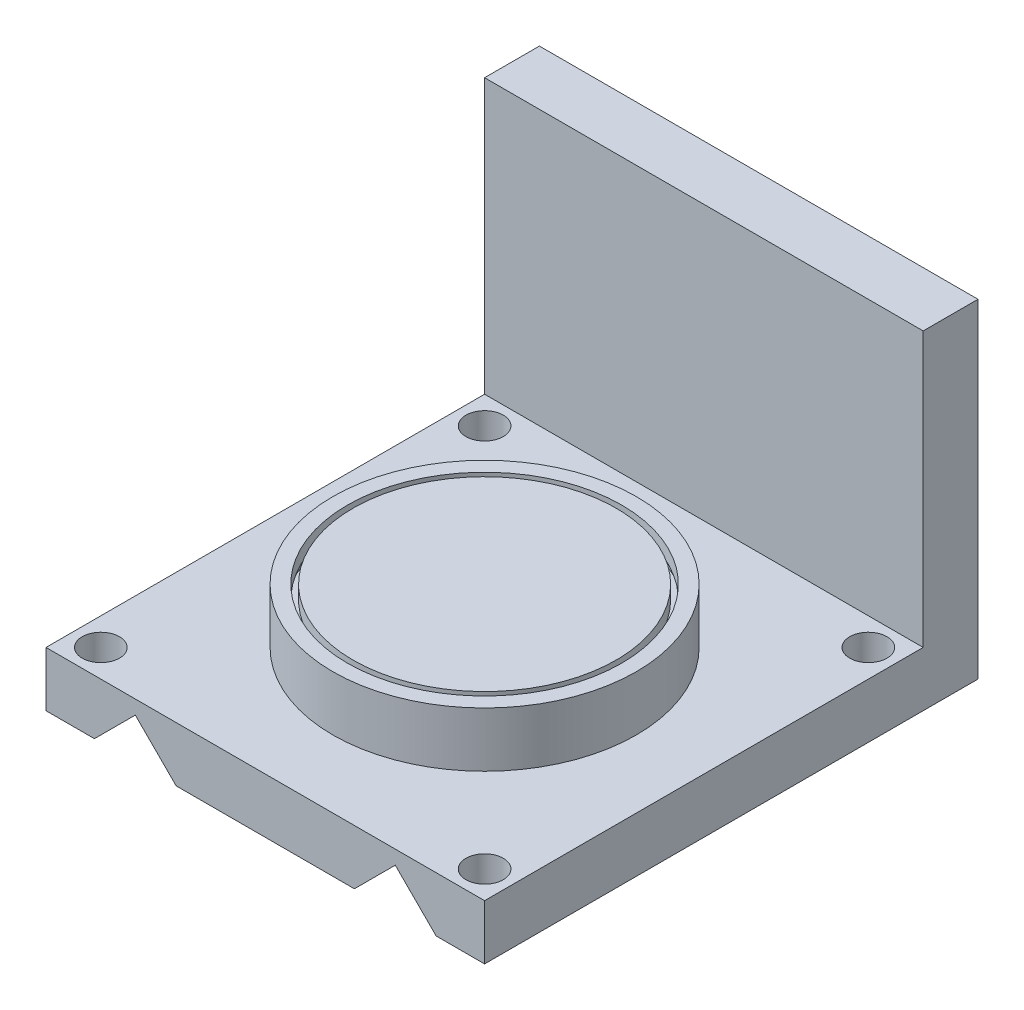
ISO-10303-21;
HEADER;
FILE_DESCRIPTION(('STEP AP214'),'2;1');
FILE_NAME('part.step','',(''),(''),'','','');
FILE_SCHEMA(('AUTOMOTIVE_DESIGN { 1 0 10303 214 1 1 1 1 }'));
ENDSEC;
DATA;
#1=APPLICATION_CONTEXT('core data for automotive mechanical design processes');
#2=APPLICATION_PROTOCOL_DEFINITION('international standard','automotive_design',2000,#1);
#3=PRODUCT_CONTEXT('',#1,'mechanical');
#4=PRODUCT('Part','Part','',(#3));
#5=PRODUCT_RELATED_PRODUCT_CATEGORY('part','',(#4));
#6=PRODUCT_DEFINITION_FORMATION('','',#4);
#7=PRODUCT_DEFINITION_CONTEXT('part definition',#1,'design');
#8=PRODUCT_DEFINITION('design','',#6,#7);
#9=PRODUCT_DEFINITION_SHAPE('','',#8);
#10=(LENGTH_UNIT() NAMED_UNIT(*) SI_UNIT(.MILLI.,.METRE.));
#11=(NAMED_UNIT(*) PLANE_ANGLE_UNIT() SI_UNIT($,.RADIAN.));
#12=(NAMED_UNIT(*) SI_UNIT($,.STERADIAN.) SOLID_ANGLE_UNIT());
#13=UNCERTAINTY_MEASURE_WITH_UNIT(LENGTH_MEASURE(1.E-05),#10,'distance_accuracy_value','');
#14=(GEOMETRIC_REPRESENTATION_CONTEXT(3) GLOBAL_UNCERTAINTY_ASSIGNED_CONTEXT((#13)) GLOBAL_UNIT_ASSIGNED_CONTEXT((#10,
#11,#12)) REPRESENTATION_CONTEXT('',''));
#15=CARTESIAN_POINT('',(0.,0.,0.));
#16=DIRECTION('',(0.,0.,1.));
#17=DIRECTION('',(1.,0.,0.));
#18=AXIS2_PLACEMENT_3D('',#15,#16,#17);
#19=CARTESIAN_POINT('',(20.,5.,20.));
#20=DIRECTION('',(-1.,0.,0.));
#21=DIRECTION('',(0.,0.,1.));
#22=AXIS2_PLACEMENT_3D('',#19,#20,#21);
#23=PLANE('',#22);
#24=DIRECTION('',(0.,0.,-1.));
#25=VECTOR('',#24,1.);
#26=CARTESIAN_POINT('',(20.,0.,20.));
#27=LINE('',#26,#25);
#28=CARTESIAN_POINT('',(20.,0.,20.));
#29=VERTEX_POINT('',#28);
#30=CARTESIAN_POINT('',(20.,0.,-25.));
#31=VERTEX_POINT('',#30);
#32=EDGE_CURVE('E124',#29,#31,#27,.T.);
#33=ORIENTED_EDGE('',*,*,#32,.T.);
#34=DIRECTION('',(0.,-1.,0.));
#35=VECTOR('',#34,1.);
#36=CARTESIAN_POINT('',(20.,30.,-25.));
#37=LINE('',#36,#35);
#38=CARTESIAN_POINT('',(20.,30.,-25.));
#39=VERTEX_POINT('',#38);
#40=EDGE_CURVE('E230',#39,#31,#37,.T.);
#41=ORIENTED_EDGE('',*,*,#40,.F.);
#42=DIRECTION('',(0.,0.,-1.));
#43=VECTOR('',#42,1.);
#44=CARTESIAN_POINT('',(20.,30.,-20.));
#45=LINE('',#44,#43);
#46=CARTESIAN_POINT('',(20.,30.,-20.));
#47=VERTEX_POINT('',#46);
#48=EDGE_CURVE('E363',#47,#39,#45,.T.);
#49=ORIENTED_EDGE('',*,*,#48,.F.);
#50=DIRECTION('',(0.,-1.,0.));
#51=VECTOR('',#50,1.);
#52=CARTESIAN_POINT('',(20.,30.,-20.));
#53=LINE('',#52,#51);
#54=CARTESIAN_POINT('',(20.,5.,-20.));
#55=VERTEX_POINT('',#54);
#56=EDGE_CURVE('E111',#47,#55,#53,.T.);
#57=ORIENTED_EDGE('',*,*,#56,.T.);
#58=DIRECTION('',(0.,0.,-1.));
#59=VECTOR('',#58,1.);
#60=CARTESIAN_POINT('',(20.,5.,20.));
#61=LINE('',#60,#59);
#62=CARTESIAN_POINT('',(20.,5.,20.));
#63=VERTEX_POINT('',#62);
#64=EDGE_CURVE('E116',#63,#55,#61,.T.);
#65=ORIENTED_EDGE('',*,*,#64,.F.);
#66=DIRECTION('',(0.,-1.,0.));
#67=VECTOR('',#66,1.);
#68=CARTESIAN_POINT('',(20.,5.,20.));
#69=LINE('',#68,#67);
#70=EDGE_CURVE('E120',#63,#29,#69,.T.);
#71=ORIENTED_EDGE('',*,*,#70,.T.);
#72=EDGE_LOOP('',(#33,#41,#49,#57,#65,#71));
#73=FACE_BOUND('',#72,.T.);
#74=ADVANCED_FACE('F37',(#73),#23,.F.);
#75=CARTESIAN_POINT('',(-20.,5.,20.));
#76=DIRECTION('',(1.,0.,0.));
#77=DIRECTION('',(0.,0.,-1.));
#78=AXIS2_PLACEMENT_3D('',#75,#76,#77);
#79=PLANE('',#78);
#80=DIRECTION('',(0.,0.,1.));
#81=VECTOR('',#80,1.);
#82=CARTESIAN_POINT('',(-20.,0.,20.));
#83=LINE('',#82,#81);
#84=CARTESIAN_POINT('',(-20.,0.,-25.));
#85=VERTEX_POINT('',#84);
#86=CARTESIAN_POINT('',(-20.,0.,20.));
#87=VERTEX_POINT('',#86);
#88=EDGE_CURVE('E67',#85,#87,#83,.T.);
#89=ORIENTED_EDGE('',*,*,#88,.T.);
#90=DIRECTION('',(0.,-1.,0.));
#91=VECTOR('',#90,1.);
#92=CARTESIAN_POINT('',(-20.,5.,20.));
#93=LINE('',#92,#91);
#94=CARTESIAN_POINT('',(-20.,5.,20.));
#95=VERTEX_POINT('',#94);
#96=EDGE_CURVE('E46',#95,#87,#93,.T.);
#97=ORIENTED_EDGE('',*,*,#96,.F.);
#98=DIRECTION('',(0.,0.,1.));
#99=VECTOR('',#98,1.);
#100=CARTESIAN_POINT('',(-20.,5.,20.));
#101=LINE('',#100,#99);
#102=CARTESIAN_POINT('',(-20.,5.,-20.));
#103=VERTEX_POINT('',#102);
#104=EDGE_CURVE('E114',#103,#95,#101,.T.);
#105=ORIENTED_EDGE('',*,*,#104,.F.);
#106=DIRECTION('',(0.,-1.,0.));
#107=VECTOR('',#106,1.);
#108=CARTESIAN_POINT('',(-20.,30.,-20.));
#109=LINE('',#108,#107);
#110=CARTESIAN_POINT('',(-20.,30.,-20.));
#111=VERTEX_POINT('',#110);
#112=EDGE_CURVE('E97',#111,#103,#109,.T.);
#113=ORIENTED_EDGE('',*,*,#112,.F.);
#114=DIRECTION('',(0.,0.,1.));
#115=VECTOR('',#114,1.);
#116=CARTESIAN_POINT('',(-20.,30.,-20.));
#117=LINE('',#116,#115);
#118=CARTESIAN_POINT('',(-20.,30.,-25.));
#119=VERTEX_POINT('',#118);
#120=EDGE_CURVE('E221',#119,#111,#117,.T.);
#121=ORIENTED_EDGE('',*,*,#120,.F.);
#122=DIRECTION('',(0.,-1.,0.));
#123=VECTOR('',#122,1.);
#124=CARTESIAN_POINT('',(-20.,30.,-25.));
#125=LINE('',#124,#123);
#126=EDGE_CURVE('E228',#119,#85,#125,.T.);
#127=ORIENTED_EDGE('',*,*,#126,.T.);
#128=EDGE_LOOP('',(#89,#97,#105,#113,#121,#127));
#129=FACE_BOUND('',#128,.T.);
#130=ADVANCED_FACE('F118',(#129),#79,.F.);
#131=CARTESIAN_POINT('',(-20.,5.,20.));
#132=DIRECTION('',(0.,0.,-1.));
#133=DIRECTION('',(-1.,0.,0.));
#134=AXIS2_PLACEMENT_3D('',#131,#132,#133);
#135=PLANE('',#134);
#136=DIRECTION('',(1.,0.,0.));
#137=VECTOR('',#136,1.);
#138=CARTESIAN_POINT('',(-20.,0.,20.));
#139=LINE('',#138,#137);
#140=CARTESIAN_POINT('',(-8.12728100073608,0.,20.));
#141=VERTEX_POINT('',#140);
#142=CARTESIAN_POINT('',(8.12728100073608,0.,20.));
#143=VERTEX_POINT('',#142);
#144=EDGE_CURVE('E133',#141,#143,#139,.T.);
#145=ORIENTED_EDGE('',*,*,#144,.T.);
#146=DIRECTION('',(-0.707106781186546,-0.707106781186549,0.));
#147=VECTOR('',#146,1.);
#148=CARTESIAN_POINT('',(8.12728100073608,0.,20.));
#149=LINE('',#148,#147);
#150=CARTESIAN_POINT('',(11.8551435979696,3.72786259723351,20.));
#151=VERTEX_POINT('',#150);
#152=EDGE_CURVE('E77',#151,#143,#149,.T.);
#153=ORIENTED_EDGE('',*,*,#152,.F.);
#154=DIRECTION('',(-0.707106781186549,0.707106781186546,0.));
#155=VECTOR('',#154,1.);
#156=CARTESIAN_POINT('',(11.8551435979696,3.72786259723351,20.));
#157=LINE('',#156,#155);
#158=CARTESIAN_POINT('',(15.5830061952031,0.,20.));
#159=VERTEX_POINT('',#158);
#160=EDGE_CURVE('E156',#159,#151,#157,.T.);
#161=ORIENTED_EDGE('',*,*,#160,.F.);
#162=EDGE_CURVE('E129',#159,#29,#139,.T.);
#163=ORIENTED_EDGE('',*,*,#162,.T.);
#164=ORIENTED_EDGE('',*,*,#70,.F.);
#165=DIRECTION('',(1.,0.,0.));
#166=VECTOR('',#165,1.);
#167=CARTESIAN_POINT('',(-20.,5.,20.));
#168=LINE('',#167,#166);
#169=EDGE_CURVE('E55',#95,#63,#168,.T.);
#170=ORIENTED_EDGE('',*,*,#169,.F.);
#171=ORIENTED_EDGE('',*,*,#96,.T.);
#172=CARTESIAN_POINT('',(-15.5830061952031,0.,20.));
#173=VERTEX_POINT('',#172);
#174=EDGE_CURVE('E130',#87,#173,#139,.T.);
#175=ORIENTED_EDGE('',*,*,#174,.T.);
#176=DIRECTION('',(-0.707106781186544,-0.707106781186551,0.));
#177=VECTOR('',#176,1.);
#178=CARTESIAN_POINT('',(-11.8551435979696,3.72786259723351,20.));
#179=LINE('',#178,#177);
#180=CARTESIAN_POINT('',(-11.8551435979696,3.72786259723351,20.));
#181=VERTEX_POINT('',#180);
#182=EDGE_CURVE('E185',#181,#173,#179,.T.);
#183=ORIENTED_EDGE('',*,*,#182,.F.);
#184=DIRECTION('',(-0.707106781186551,0.707106781186544,0.));
#185=VECTOR('',#184,1.);
#186=CARTESIAN_POINT('',(-8.12728100073608,0.,20.));
#187=LINE('',#186,#185);
#188=EDGE_CURVE('E159',#141,#181,#187,.T.);
#189=ORIENTED_EDGE('',*,*,#188,.F.);
#190=EDGE_LOOP('',(#145,#153,#161,#163,#164,#170,#171,#175,#183,#189));
#191=FACE_BOUND('',#190,.T.);
#192=ADVANCED_FACE('F200',(#191),#135,.F.);
#193=CARTESIAN_POINT('',(0.,5.,0.));
#194=DIRECTION('',(0.,-1.,0.));
#195=DIRECTION('',(0.,0.,-1.));
#196=AXIS2_PLACEMENT_3D('',#193,#194,#195);
#197=PLANE('',#196);
#198=CARTESIAN_POINT('',(0.,5.,0.));
#199=DIRECTION('',(0.,1.,0.));
#200=DIRECTION('',(0.,0.,1.));
#201=AXIS2_PLACEMENT_3D('',#198,#199,#200);
#202=CIRCLE('',#201,13.8362336587027);
#203=CARTESIAN_POINT('',(0.,5.,13.8362336587027));
#204=VERTEX_POINT('',#203);
#205=EDGE_CURVE('E11',#204,#204,#202,.T.);
#206=ORIENTED_EDGE('',*,*,#205,.F.);
#207=EDGE_LOOP('',(#206));
#208=FACE_BOUND('',#207,.T.);
#209=CARTESIAN_POINT('',(17.5,5.,17.5));
#210=DIRECTION('',(0.,1.,0.));
#211=DIRECTION('',(0.,0.,1.));
#212=AXIS2_PLACEMENT_3D('',#209,#210,#211);
#213=CIRCLE('',#212,1.7);
#214=CARTESIAN_POINT('',(17.5,5.,19.2));
#215=VERTEX_POINT('',#214);
#216=EDGE_CURVE('E256',#215,#215,#213,.T.);
#217=ORIENTED_EDGE('',*,*,#216,.F.);
#218=EDGE_LOOP('',(#217));
#219=FACE_BOUND('',#218,.T.);
#220=CARTESIAN_POINT('',(17.5,5.,-17.5));
#221=DIRECTION('',(0.,1.,0.));
#222=DIRECTION('',(0.,0.,1.));
#223=AXIS2_PLACEMENT_3D('',#220,#221,#222);
#224=CIRCLE('',#223,1.7);
#225=CARTESIAN_POINT('',(17.5,5.,-15.8));
#226=VERTEX_POINT('',#225);
#227=EDGE_CURVE('E261',#226,#226,#224,.T.);
#228=ORIENTED_EDGE('',*,*,#227,.F.);
#229=EDGE_LOOP('',(#228));
#230=FACE_BOUND('',#229,.T.);
#231=CARTESIAN_POINT('',(-17.5,5.,-17.5));
#232=DIRECTION('',(0.,1.,0.));
#233=DIRECTION('',(0.,0.,1.));
#234=AXIS2_PLACEMENT_3D('',#231,#232,#233);
#235=CIRCLE('',#234,1.7);
#236=CARTESIAN_POINT('',(-17.5,5.,-15.8));
#237=VERTEX_POINT('',#236);
#238=EDGE_CURVE('E258',#237,#237,#235,.T.);
#239=ORIENTED_EDGE('',*,*,#238,.F.);
#240=EDGE_LOOP('',(#239));
#241=FACE_BOUND('',#240,.T.);
#242=CARTESIAN_POINT('',(-17.5,5.,17.5));
#243=DIRECTION('',(0.,1.,0.));
#244=DIRECTION('',(0.,0.,1.));
#245=AXIS2_PLACEMENT_3D('',#242,#243,#244);
#246=CIRCLE('',#245,1.7);
#247=CARTESIAN_POINT('',(-17.5,5.,19.2));
#248=VERTEX_POINT('',#247);
#249=EDGE_CURVE('E140',#248,#248,#246,.T.);
#250=ORIENTED_EDGE('',*,*,#249,.F.);
#251=EDGE_LOOP('',(#250));
#252=FACE_BOUND('',#251,.T.);
#253=ORIENTED_EDGE('',*,*,#64,.T.);
#254=DIRECTION('',(-1.,0.,0.));
#255=VECTOR('',#254,1.);
#256=CARTESIAN_POINT('',(-20.,5.,-20.));
#257=LINE('',#256,#255);
#258=EDGE_CURVE('E102',#55,#103,#257,.T.);
#259=ORIENTED_EDGE('',*,*,#258,.T.);
#260=ORIENTED_EDGE('',*,*,#104,.T.);
#261=ORIENTED_EDGE('',*,*,#169,.T.);
#262=EDGE_LOOP('',(#253,#259,#260,#261));
#263=FACE_BOUND('',#262,.T.);
#264=ADVANCED_FACE('F113',(#208,#219,#230,#241,#252,#263),#197,.F.);
#265=CARTESIAN_POINT('',(0.,0.,0.));
#266=DIRECTION('',(0.,-1.,0.));
#267=DIRECTION('',(0.,0.,-1.));
#268=AXIS2_PLACEMENT_3D('',#265,#266,#267);
#269=PLANE('',#268);
#270=CARTESIAN_POINT('',(17.5,0.,17.5));
#271=DIRECTION('',(0.,-1.,0.));
#272=DIRECTION('',(0.,0.,-1.));
#273=AXIS2_PLACEMENT_3D('',#270,#271,#272);
#274=CIRCLE('',#273,1.7);
#275=CARTESIAN_POINT('',(17.5,0.,15.8));
#276=VERTEX_POINT('',#275);
#277=EDGE_CURVE('E139',#276,#276,#274,.T.);
#278=ORIENTED_EDGE('',*,*,#277,.F.);
#279=EDGE_LOOP('',(#278));
#280=FACE_BOUND('',#279,.T.);
#281=CARTESIAN_POINT('',(17.5,0.,-17.5));
#282=DIRECTION('',(0.,-1.,0.));
#283=DIRECTION('',(0.,0.,-1.));
#284=AXIS2_PLACEMENT_3D('',#281,#282,#283);
#285=CIRCLE('',#284,1.7);
#286=CARTESIAN_POINT('',(17.5,0.,-19.2));
#287=VERTEX_POINT('',#286);
#288=EDGE_CURVE('E137',#287,#287,#285,.T.);
#289=ORIENTED_EDGE('',*,*,#288,.F.);
#290=EDGE_LOOP('',(#289));
#291=FACE_BOUND('',#290,.T.);
#292=DIRECTION('',(0.,0.,1.));
#293=VECTOR('',#292,1.);
#294=CARTESIAN_POINT('',(15.5830061952031,0.,-20.));
#295=LINE('',#294,#293);
#296=CARTESIAN_POINT('',(15.5830061952031,0.,-20.));
#297=VERTEX_POINT('',#296);
#298=EDGE_CURVE('E167',#297,#159,#295,.T.);
#299=ORIENTED_EDGE('',*,*,#298,.F.);
#300=DIRECTION('',(1.,0.,0.));
#301=VECTOR('',#300,1.);
#302=CARTESIAN_POINT('',(-20.,0.,-20.));
#303=LINE('',#302,#301);
#304=CARTESIAN_POINT('',(8.12728100073607,0.,-20.));
#305=VERTEX_POINT('',#304);
#306=EDGE_CURVE('E218',#305,#297,#303,.T.);
#307=ORIENTED_EDGE('',*,*,#306,.F.);
#308=DIRECTION('',(0.,0.,1.));
#309=VECTOR('',#308,1.);
#310=CARTESIAN_POINT('',(8.12728100073608,0.,-20.));
#311=LINE('',#310,#309);
#312=EDGE_CURVE('E127',#305,#143,#311,.T.);
#313=ORIENTED_EDGE('',*,*,#312,.T.);
#314=ORIENTED_EDGE('',*,*,#144,.F.);
#315=DIRECTION('',(0.,0.,1.));
#316=VECTOR('',#315,1.);
#317=CARTESIAN_POINT('',(-8.12728100073608,0.,-20.));
#318=LINE('',#317,#316);
#319=CARTESIAN_POINT('',(-8.12728100073608,0.,-20.));
#320=VERTEX_POINT('',#319);
#321=EDGE_CURVE('E173',#320,#141,#318,.T.);
#322=ORIENTED_EDGE('',*,*,#321,.F.);
#323=CARTESIAN_POINT('',(-15.5830061952031,0.,-20.));
#324=VERTEX_POINT('',#323);
#325=EDGE_CURVE('E212',#324,#320,#303,.T.);
#326=ORIENTED_EDGE('',*,*,#325,.F.);
#327=DIRECTION('',(0.,0.,1.));
#328=VECTOR('',#327,1.);
#329=CARTESIAN_POINT('',(-15.5830061952031,0.,-20.));
#330=LINE('',#329,#328);
#331=EDGE_CURVE('E151',#324,#173,#330,.T.);
#332=ORIENTED_EDGE('',*,*,#331,.T.);
#333=ORIENTED_EDGE('',*,*,#174,.F.);
#334=ORIENTED_EDGE('',*,*,#88,.F.);
#335=DIRECTION('',(-1.,0.,0.));
#336=VECTOR('',#335,1.);
#337=CARTESIAN_POINT('',(-20.,0.,-25.));
#338=LINE('',#337,#336);
#339=EDGE_CURVE('E217',#31,#85,#338,.T.);
#340=ORIENTED_EDGE('',*,*,#339,.F.);
#341=ORIENTED_EDGE('',*,*,#32,.F.);
#342=ORIENTED_EDGE('',*,*,#162,.F.);
#343=EDGE_LOOP('',(#299,#307,#313,#314,#322,#326,#332,#333,#334,#340,#341,#342));
#344=FACE_BOUND('',#343,.T.);
#345=CARTESIAN_POINT('',(-17.5,0.,-17.5));
#346=DIRECTION('',(0.,-1.,0.));
#347=DIRECTION('',(0.,0.,-1.));
#348=AXIS2_PLACEMENT_3D('',#345,#346,#347);
#349=CIRCLE('',#348,1.7);
#350=CARTESIAN_POINT('',(-17.5,0.,-19.2));
#351=VERTEX_POINT('',#350);
#352=EDGE_CURVE('E146',#351,#351,#349,.T.);
#353=ORIENTED_EDGE('',*,*,#352,.F.);
#354=EDGE_LOOP('',(#353));
#355=FACE_BOUND('',#354,.T.);
#356=CARTESIAN_POINT('',(-17.5,0.,17.5));
#357=DIRECTION('',(0.,-1.,0.));
#358=DIRECTION('',(0.,0.,-1.));
#359=AXIS2_PLACEMENT_3D('',#356,#357,#358);
#360=CIRCLE('',#359,1.7);
#361=CARTESIAN_POINT('',(-17.5,0.,15.8));
#362=VERTEX_POINT('',#361);
#363=EDGE_CURVE('E142',#362,#362,#360,.T.);
#364=ORIENTED_EDGE('',*,*,#363,.F.);
#365=EDGE_LOOP('',(#364));
#366=FACE_BOUND('',#365,.T.);
#367=ADVANCED_FACE('F209',(#280,#291,#344,#355,#366),#269,.T.);
#368=CARTESIAN_POINT('',(-11.8551435979696,3.72786259723351,-20.));
#369=DIRECTION('',(-0.707106781186551,0.707106781186544,0.));
#370=DIRECTION('',(-0.707106781186544,-0.707106781186551,0.));
#371=AXIS2_PLACEMENT_3D('',#368,#369,#370);
#372=PLANE('',#371);
#373=ORIENTED_EDGE('',*,*,#331,.F.);
#374=DIRECTION('',(-0.707106781186544,-0.707106781186551,0.));
#375=VECTOR('',#374,1.);
#376=CARTESIAN_POINT('',(-11.8551435979696,3.72786259723351,-20.));
#377=LINE('',#376,#375);
#378=CARTESIAN_POINT('',(-11.8551435979696,3.72786259723351,-20.));
#379=VERTEX_POINT('',#378);
#380=EDGE_CURVE('E175',#379,#324,#377,.T.);
#381=ORIENTED_EDGE('',*,*,#380,.F.);
#382=DIRECTION('',(0.,0.,1.));
#383=VECTOR('',#382,1.);
#384=CARTESIAN_POINT('',(-11.8551435979696,3.72786259723351,-20.));
#385=LINE('',#384,#383);
#386=EDGE_CURVE('E176',#379,#181,#385,.T.);
#387=ORIENTED_EDGE('',*,*,#386,.T.);
#388=ORIENTED_EDGE('',*,*,#182,.T.);
#389=EDGE_LOOP('',(#373,#381,#387,#388));
#390=FACE_BOUND('',#389,.T.);
#391=ADVANCED_FACE('F204',(#390),#372,.F.);
#392=CARTESIAN_POINT('',(-8.12728100073608,0.,-20.));
#393=DIRECTION('',(0.707106781186544,0.707106781186551,0.));
#394=DIRECTION('',(-0.707106781186551,0.707106781186544,0.));
#395=AXIS2_PLACEMENT_3D('',#392,#393,#394);
#396=PLANE('',#395);
#397=ORIENTED_EDGE('',*,*,#386,.F.);
#398=DIRECTION('',(-0.707106781186551,0.707106781186544,0.));
#399=VECTOR('',#398,1.);
#400=CARTESIAN_POINT('',(-8.12728100073608,0.,-20.));
#401=LINE('',#400,#399);
#402=EDGE_CURVE('E182',#320,#379,#401,.T.);
#403=ORIENTED_EDGE('',*,*,#402,.F.);
#404=ORIENTED_EDGE('',*,*,#321,.T.);
#405=ORIENTED_EDGE('',*,*,#188,.T.);
#406=EDGE_LOOP('',(#397,#403,#404,#405));
#407=FACE_BOUND('',#406,.T.);
#408=ADVANCED_FACE('F192',(#407),#396,.F.);
#409=CARTESIAN_POINT('',(8.12728100073608,0.,-20.));
#410=DIRECTION('',(-0.707106781186549,0.707106781186546,0.));
#411=DIRECTION('',(-0.707106781186546,-0.707106781186549,0.));
#412=AXIS2_PLACEMENT_3D('',#409,#410,#411);
#413=PLANE('',#412);
#414=ORIENTED_EDGE('',*,*,#312,.F.);
#415=DIRECTION('',(-0.707106781186546,-0.707106781186549,0.));
#416=VECTOR('',#415,1.);
#417=CARTESIAN_POINT('',(8.12728100073608,0.,-20.));
#418=LINE('',#417,#416);
#419=CARTESIAN_POINT('',(11.8551435979696,3.72786259723351,-20.));
#420=VERTEX_POINT('',#419);
#421=EDGE_CURVE('E164',#420,#305,#418,.T.);
#422=ORIENTED_EDGE('',*,*,#421,.F.);
#423=DIRECTION('',(0.,0.,1.));
#424=VECTOR('',#423,1.);
#425=CARTESIAN_POINT('',(11.8551435979696,3.72786259723351,-20.));
#426=LINE('',#425,#424);
#427=EDGE_CURVE('E169',#420,#151,#426,.T.);
#428=ORIENTED_EDGE('',*,*,#427,.T.);
#429=ORIENTED_EDGE('',*,*,#152,.T.);
#430=EDGE_LOOP('',(#414,#422,#428,#429));
#431=FACE_BOUND('',#430,.T.);
#432=ADVANCED_FACE('F332',(#431),#413,.F.);
#433=CARTESIAN_POINT('',(11.8551435979696,3.72786259723351,-20.));
#434=DIRECTION('',(0.707106781186546,0.707106781186549,0.));
#435=DIRECTION('',(-0.707106781186549,0.707106781186546,0.));
#436=AXIS2_PLACEMENT_3D('',#433,#434,#435);
#437=PLANE('',#436);
#438=ORIENTED_EDGE('',*,*,#427,.F.);
#439=DIRECTION('',(-0.707106781186549,0.707106781186546,0.));
#440=VECTOR('',#439,1.);
#441=CARTESIAN_POINT('',(11.8551435979696,3.72786259723351,-20.));
#442=LINE('',#441,#440);
#443=EDGE_CURVE('E161',#297,#420,#442,.T.);
#444=ORIENTED_EDGE('',*,*,#443,.F.);
#445=ORIENTED_EDGE('',*,*,#298,.T.);
#446=ORIENTED_EDGE('',*,*,#160,.T.);
#447=EDGE_LOOP('',(#438,#444,#445,#446));
#448=FACE_BOUND('',#447,.T.);
#449=ADVANCED_FACE('F329',(#448),#437,.F.);
#450=CARTESIAN_POINT('',(17.5,-1.2E-05,-17.5));
#451=DIRECTION('',(0.,1.,0.));
#452=DIRECTION('',(0.,0.,1.));
#453=AXIS2_PLACEMENT_3D('',#450,#451,#452);
#454=CYLINDRICAL_SURFACE('',#453,1.7);
#455=ORIENTED_EDGE('',*,*,#288,.T.);
#456=EDGE_LOOP('',(#455));
#457=FACE_BOUND('',#456,.T.);
#458=ORIENTED_EDGE('',*,*,#227,.T.);
#459=EDGE_LOOP('',(#458));
#460=FACE_BOUND('',#459,.T.);
#461=ADVANCED_FACE('F290',(#457,#460),#454,.F.);
#462=CARTESIAN_POINT('',(17.5,-1.2E-05,17.5));
#463=DIRECTION('',(0.,1.,0.));
#464=DIRECTION('',(0.,0.,1.));
#465=AXIS2_PLACEMENT_3D('',#462,#463,#464);
#466=CYLINDRICAL_SURFACE('',#465,1.7);
#467=ORIENTED_EDGE('',*,*,#277,.T.);
#468=EDGE_LOOP('',(#467));
#469=FACE_BOUND('',#468,.T.);
#470=ORIENTED_EDGE('',*,*,#216,.T.);
#471=EDGE_LOOP('',(#470));
#472=FACE_BOUND('',#471,.T.);
#473=ADVANCED_FACE('F266',(#469,#472),#466,.F.);
#474=CARTESIAN_POINT('',(-17.5,-1.2E-05,17.5));
#475=DIRECTION('',(0.,1.,0.));
#476=DIRECTION('',(0.,0.,1.));
#477=AXIS2_PLACEMENT_3D('',#474,#475,#476);
#478=CYLINDRICAL_SURFACE('',#477,1.7);
#479=ORIENTED_EDGE('',*,*,#363,.T.);
#480=EDGE_LOOP('',(#479));
#481=FACE_BOUND('',#480,.T.);
#482=ORIENTED_EDGE('',*,*,#249,.T.);
#483=EDGE_LOOP('',(#482));
#484=FACE_BOUND('',#483,.T.);
#485=ADVANCED_FACE('F279',(#481,#484),#478,.F.);
#486=CARTESIAN_POINT('',(-17.5,-1.2E-05,-17.5));
#487=DIRECTION('',(0.,1.,0.));
#488=DIRECTION('',(0.,0.,1.));
#489=AXIS2_PLACEMENT_3D('',#486,#487,#488);
#490=CYLINDRICAL_SURFACE('',#489,1.7);
#491=ORIENTED_EDGE('',*,*,#352,.T.);
#492=EDGE_LOOP('',(#491));
#493=FACE_BOUND('',#492,.T.);
#494=ORIENTED_EDGE('',*,*,#238,.T.);
#495=EDGE_LOOP('',(#494));
#496=FACE_BOUND('',#495,.T.);
#497=ADVANCED_FACE('F281',(#493,#496),#490,.F.);
#498=CARTESIAN_POINT('',(0.,10.,0.));
#499=DIRECTION('',(0.,-1.,0.));
#500=DIRECTION('',(0.,0.,-1.));
#501=AXIS2_PLACEMENT_3D('',#498,#499,#500);
#502=CYLINDRICAL_SURFACE('',#501,13.8362336587027);
#503=CARTESIAN_POINT('',(0.,10.,0.));
#504=DIRECTION('',(0.,1.,0.));
#505=DIRECTION('',(0.,0.,1.));
#506=AXIS2_PLACEMENT_3D('',#503,#504,#505);
#507=CIRCLE('',#506,13.8362336587027);
#508=CARTESIAN_POINT('',(0.,10.,13.8362336587027));
#509=VERTEX_POINT('',#508);
#510=EDGE_CURVE('E254',#509,#509,#507,.T.);
#511=ORIENTED_EDGE('',*,*,#510,.F.);
#512=EDGE_LOOP('',(#511));
#513=FACE_BOUND('',#512,.T.);
#514=ORIENTED_EDGE('',*,*,#205,.T.);
#515=EDGE_LOOP('',(#514));
#516=FACE_BOUND('',#515,.T.);
#517=ADVANCED_FACE('F287',(#513,#516),#502,.T.);
#518=CARTESIAN_POINT('',(0.,10.,0.));
#519=DIRECTION('',(0.,1.,0.));
#520=DIRECTION('',(0.,0.,1.));
#521=AXIS2_PLACEMENT_3D('',#518,#519,#520);
#522=PLANE('',#521);
#523=CARTESIAN_POINT('',(0.,10.,0.));
#524=DIRECTION('',(0.,1.,0.));
#525=DIRECTION('',(0.,0.,1.));
#526=AXIS2_PLACEMENT_3D('',#523,#524,#525);
#527=CIRCLE('',#526,12.5);
#528=CARTESIAN_POINT('',(0.,10.,12.5));
#529=VERTEX_POINT('',#528);
#530=EDGE_CURVE('E251',#529,#529,#527,.T.);
#531=ORIENTED_EDGE('',*,*,#530,.F.);
#532=EDGE_LOOP('',(#531));
#533=FACE_BOUND('',#532,.T.);
#534=ORIENTED_EDGE('',*,*,#510,.T.);
#535=EDGE_LOOP('',(#534));
#536=FACE_BOUND('',#535,.T.);
#537=ADVANCED_FACE('F506',(#533,#536),#522,.T.);
#538=CARTESIAN_POINT('',(0.,7.5,0.));
#539=DIRECTION('',(0.,1.,0.));
#540=DIRECTION('',(0.,0.,1.));
#541=AXIS2_PLACEMENT_3D('',#538,#539,#540);
#542=CYLINDRICAL_SURFACE('',#541,12.5);
#543=CARTESIAN_POINT('',(0.,8.75,0.));
#544=DIRECTION('',(0.,1.,0.));
#545=DIRECTION('',(0.,0.,1.));
#546=AXIS2_PLACEMENT_3D('',#543,#544,#545);
#547=CIRCLE('',#546,12.5);
#548=CARTESIAN_POINT('',(0.,8.75,12.5));
#549=VERTEX_POINT('',#548);
#550=EDGE_CURVE('E245',#549,#549,#547,.F.);
#551=ORIENTED_EDGE('',*,*,#550,.T.);
#552=EDGE_LOOP('',(#551));
#553=FACE_BOUND('',#552,.T.);
#554=ORIENTED_EDGE('',*,*,#530,.T.);
#555=EDGE_LOOP('',(#554));
#556=FACE_BOUND('',#555,.T.);
#557=ADVANCED_FACE('F498',(#553,#556),#542,.F.);
#558=CARTESIAN_POINT('',(0.,8.75,0.));
#559=DIRECTION('',(0.,1.,0.));
#560=DIRECTION('',(0.,0.,1.));
#561=AXIS2_PLACEMENT_3D('',#558,#559,#560);
#562=PLANE('',#561);
#563=CARTESIAN_POINT('',(0.,8.75,0.));
#564=DIRECTION('',(0.,1.,0.));
#565=DIRECTION('',(0.,0.,1.));
#566=AXIS2_PLACEMENT_3D('',#563,#564,#565);
#567=CIRCLE('',#566,13.);
#568=CARTESIAN_POINT('',(0.,8.75,13.));
#569=VERTEX_POINT('',#568);
#570=EDGE_CURVE('E240',#569,#569,#567,.T.);
#571=ORIENTED_EDGE('',*,*,#570,.F.);
#572=EDGE_LOOP('',(#571));
#573=FACE_BOUND('',#572,.T.);
#574=ORIENTED_EDGE('',*,*,#550,.F.);
#575=EDGE_LOOP('',(#574));
#576=FACE_BOUND('',#575,.T.);
#577=ADVANCED_FACE('F469',(#573,#576),#562,.F.);
#578=CARTESIAN_POINT('',(0.,8.75,0.));
#579=DIRECTION('',(0.,-1.,0.));
#580=DIRECTION('',(0.,0.,-1.));
#581=AXIS2_PLACEMENT_3D('',#578,#579,#580);
#582=CYLINDRICAL_SURFACE('',#581,13.);
#583=ORIENTED_EDGE('',*,*,#570,.T.);
#584=EDGE_LOOP('',(#583));
#585=FACE_BOUND('',#584,.T.);
#586=CARTESIAN_POINT('',(0.,7.5,0.));
#587=DIRECTION('',(0.,1.,0.));
#588=DIRECTION('',(0.,0.,1.));
#589=AXIS2_PLACEMENT_3D('',#586,#587,#588);
#590=CIRCLE('',#589,13.);
#591=CARTESIAN_POINT('',(0.,7.5,13.));
#592=VERTEX_POINT('',#591);
#593=EDGE_CURVE('E237',#592,#592,#590,.T.);
#594=ORIENTED_EDGE('',*,*,#593,.F.);
#595=EDGE_LOOP('',(#594));
#596=FACE_BOUND('',#595,.T.);
#597=ADVANCED_FACE('F478',(#585,#596),#582,.F.);
#598=CARTESIAN_POINT('',(0.,7.5,0.));
#599=DIRECTION('',(0.,1.,0.));
#600=DIRECTION('',(0.,0.,1.));
#601=AXIS2_PLACEMENT_3D('',#598,#599,#600);
#602=PLANE('',#601);
#603=CARTESIAN_POINT('',(0.,7.5,0.));
#604=DIRECTION('',(0.,1.,0.));
#605=DIRECTION('',(0.,0.,1.));
#606=AXIS2_PLACEMENT_3D('',#603,#604,#605);
#607=CIRCLE('',#606,11.5);
#608=CARTESIAN_POINT('',(0.,7.5,11.5));
#609=VERTEX_POINT('',#608);
#610=EDGE_CURVE('E110',#609,#609,#607,.T.);
#611=ORIENTED_EDGE('',*,*,#610,.F.);
#612=EDGE_LOOP('',(#611));
#613=FACE_BOUND('',#612,.T.);
#614=ORIENTED_EDGE('',*,*,#593,.T.);
#615=EDGE_LOOP('',(#614));
#616=FACE_BOUND('',#615,.T.);
#617=ADVANCED_FACE('F466',(#613,#616),#602,.T.);
#618=CARTESIAN_POINT('',(0.,8.75,0.));
#619=DIRECTION('',(0.,1.,0.));
#620=DIRECTION('',(0.,0.,1.));
#621=AXIS2_PLACEMENT_3D('',#618,#619,#620);
#622=CIRCLE('',#621,12.);
#623=CARTESIAN_POINT('',(0.,8.75,12.));
#624=VERTEX_POINT('',#623);
#625=EDGE_CURVE('E40',#624,#624,#622,.F.);
#626=ORIENTED_EDGE('',*,*,#625,.T.);
#627=EDGE_LOOP('',(#626));
#628=FACE_BOUND('',#627,.T.);
#629=CARTESIAN_POINT('',(0.,8.75,0.));
#630=DIRECTION('',(0.,1.,0.));
#631=DIRECTION('',(0.,0.,1.));
#632=AXIS2_PLACEMENT_3D('',#629,#630,#631);
#633=CIRCLE('',#632,11.5);
#634=CARTESIAN_POINT('',(0.,8.75,11.5));
#635=VERTEX_POINT('',#634);
#636=EDGE_CURVE('E234',#635,#635,#633,.T.);
#637=ORIENTED_EDGE('',*,*,#636,.T.);
#638=EDGE_LOOP('',(#637));
#639=FACE_BOUND('',#638,.T.);
#640=ADVANCED_FACE('F456',(#628,#639),#562,.F.);
#641=CARTESIAN_POINT('',(0.,8.75,0.));
#642=DIRECTION('',(0.,-1.,0.));
#643=DIRECTION('',(0.,0.,-1.));
#644=AXIS2_PLACEMENT_3D('',#641,#642,#643);
#645=CYLINDRICAL_SURFACE('',#644,11.5);
#646=ORIENTED_EDGE('',*,*,#636,.F.);
#647=EDGE_LOOP('',(#646));
#648=FACE_BOUND('',#647,.T.);
#649=ORIENTED_EDGE('',*,*,#610,.T.);
#650=EDGE_LOOP('',(#649));
#651=FACE_BOUND('',#650,.T.);
#652=ADVANCED_FACE('F453',(#648,#651),#645,.T.);
#653=CARTESIAN_POINT('',(0.,10.,0.));
#654=DIRECTION('',(0.,1.,0.));
#655=DIRECTION('',(0.,0.,1.));
#656=AXIS2_PLACEMENT_3D('',#653,#654,#655);
#657=CIRCLE('',#656,12.);
#658=CARTESIAN_POINT('',(0.,10.,12.));
#659=VERTEX_POINT('',#658);
#660=EDGE_CURVE('E248',#659,#659,#657,.T.);
#661=ORIENTED_EDGE('',*,*,#660,.T.);
#662=EDGE_LOOP('',(#661));
#663=FACE_BOUND('',#662,.T.);
#664=ADVANCED_FACE('F344',(#663),#522,.T.);
#665=CARTESIAN_POINT('',(0.,7.5,0.));
#666=DIRECTION('',(0.,1.,0.));
#667=DIRECTION('',(0.,0.,1.));
#668=AXIS2_PLACEMENT_3D('',#665,#666,#667);
#669=CYLINDRICAL_SURFACE('',#668,12.);
#670=ORIENTED_EDGE('',*,*,#625,.F.);
#671=EDGE_LOOP('',(#670));
#672=FACE_BOUND('',#671,.T.);
#673=ORIENTED_EDGE('',*,*,#660,.F.);
#674=EDGE_LOOP('',(#673));
#675=FACE_BOUND('',#674,.T.);
#676=ADVANCED_FACE('F337',(#672,#675),#669,.T.);
#677=CARTESIAN_POINT('',(-20.,30.,-20.));
#678=DIRECTION('',(0.,0.,-1.));
#679=DIRECTION('',(-1.,0.,0.));
#680=AXIS2_PLACEMENT_3D('',#677,#678,#679);
#681=PLANE('',#680);
#682=ORIENTED_EDGE('',*,*,#306,.T.);
#683=ORIENTED_EDGE('',*,*,#443,.T.);
#684=ORIENTED_EDGE('',*,*,#421,.T.);
#685=EDGE_LOOP('',(#682,#683,#684));
#686=FACE_BOUND('',#685,.T.);
#687=ADVANCED_FACE('F334',(#686),#681,.F.);
#688=ORIENTED_EDGE('',*,*,#325,.T.);
#689=ORIENTED_EDGE('',*,*,#402,.T.);
#690=ORIENTED_EDGE('',*,*,#380,.T.);
#691=EDGE_LOOP('',(#688,#689,#690));
#692=FACE_BOUND('',#691,.T.);
#693=ADVANCED_FACE('F336',(#692),#681,.F.);
#694=ORIENTED_EDGE('',*,*,#258,.F.);
#695=ORIENTED_EDGE('',*,*,#56,.F.);
#696=DIRECTION('',(1.,0.,0.));
#697=VECTOR('',#696,1.);
#698=CARTESIAN_POINT('',(-20.,30.,-20.));
#699=LINE('',#698,#697);
#700=EDGE_CURVE('E106',#111,#47,#699,.T.);
#701=ORIENTED_EDGE('',*,*,#700,.F.);
#702=ORIENTED_EDGE('',*,*,#112,.T.);
#703=EDGE_LOOP('',(#694,#695,#701,#702));
#704=FACE_BOUND('',#703,.T.);
#705=ADVANCED_FACE('F99',(#704),#681,.F.);
#706=CARTESIAN_POINT('',(-20.,30.,-25.));
#707=DIRECTION('',(0.,0.,1.));
#708=DIRECTION('',(1.,0.,0.));
#709=AXIS2_PLACEMENT_3D('',#706,#707,#708);
#710=PLANE('',#709);
#711=ORIENTED_EDGE('',*,*,#339,.T.);
#712=ORIENTED_EDGE('',*,*,#126,.F.);
#713=DIRECTION('',(-1.,0.,0.));
#714=VECTOR('',#713,1.);
#715=CARTESIAN_POINT('',(-20.,30.,-25.));
#716=LINE('',#715,#714);
#717=EDGE_CURVE('E225',#39,#119,#716,.T.);
#718=ORIENTED_EDGE('',*,*,#717,.F.);
#719=ORIENTED_EDGE('',*,*,#40,.T.);
#720=EDGE_LOOP('',(#711,#712,#718,#719));
#721=FACE_BOUND('',#720,.T.);
#722=ADVANCED_FACE('F310',(#721),#710,.F.);
#723=CARTESIAN_POINT('',(0.,30.,0.));
#724=DIRECTION('',(0.,-1.,0.));
#725=DIRECTION('',(0.,0.,-1.));
#726=AXIS2_PLACEMENT_3D('',#723,#724,#725);
#727=PLANE('',#726);
#728=ORIENTED_EDGE('',*,*,#120,.T.);
#729=ORIENTED_EDGE('',*,*,#700,.T.);
#730=ORIENTED_EDGE('',*,*,#48,.T.);
#731=ORIENTED_EDGE('',*,*,#717,.T.);
#732=EDGE_LOOP('',(#728,#729,#730,#731));
#733=FACE_BOUND('',#732,.T.);
#734=ADVANCED_FACE('F353',(#733),#727,.F.);
#735=CLOSED_SHELL('',(#74,#130,#192,#264,#367,#391,#408,#432,#449,#461,#473,#485,#497,#517,#537,
#557,#577,#597,#617,#640,#652,#664,#676,#687,#693,#705,#722,#734));
#736=MANIFOLD_SOLID_BREP('B2',#735);
#737=ADVANCED_BREP_SHAPE_REPRESENTATION('',(#18,#736),#14);
#738=SHAPE_DEFINITION_REPRESENTATION(#9,#737);
ENDSEC;
END-ISO-10303-21;
